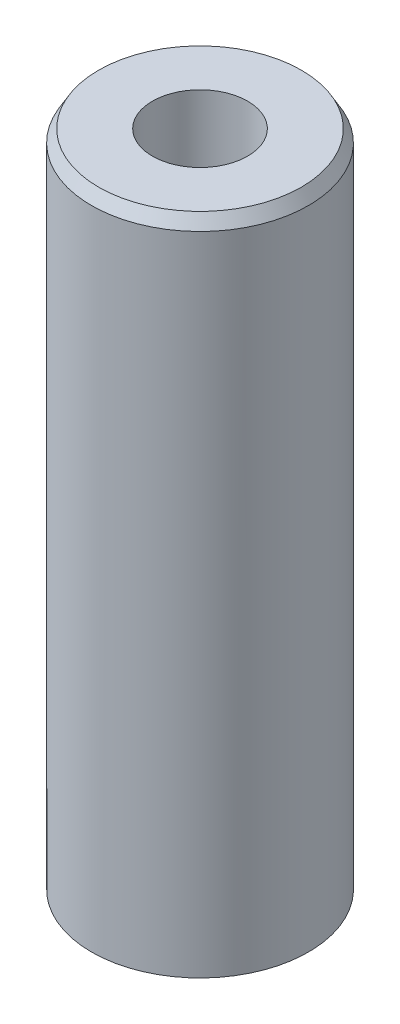
ISO-10303-21;
HEADER;
FILE_DESCRIPTION(('STEP AP214'),'2;1');
FILE_NAME('part.step','',(''),(''),'','','');
FILE_SCHEMA(('AUTOMOTIVE_DESIGN { 1 0 10303 214 1 1 1 1 }'));
ENDSEC;
DATA;
#1=APPLICATION_CONTEXT('core data for automotive mechanical design processes');
#2=APPLICATION_PROTOCOL_DEFINITION('international standard','automotive_design',2000,#1);
#3=PRODUCT_CONTEXT('',#1,'mechanical');
#4=PRODUCT('Part','Part','',(#3));
#5=PRODUCT_RELATED_PRODUCT_CATEGORY('part','',(#4));
#6=PRODUCT_DEFINITION_FORMATION('','',#4);
#7=PRODUCT_DEFINITION_CONTEXT('part definition',#1,'design');
#8=PRODUCT_DEFINITION('design','',#6,#7);
#9=PRODUCT_DEFINITION_SHAPE('','',#8);
#10=(LENGTH_UNIT() NAMED_UNIT(*) SI_UNIT(.MILLI.,.METRE.));
#11=(NAMED_UNIT(*) PLANE_ANGLE_UNIT() SI_UNIT($,.RADIAN.));
#12=(NAMED_UNIT(*) SI_UNIT($,.STERADIAN.) SOLID_ANGLE_UNIT());
#13=UNCERTAINTY_MEASURE_WITH_UNIT(LENGTH_MEASURE(1.E-05),#10,'distance_accuracy_value','');
#14=(GEOMETRIC_REPRESENTATION_CONTEXT(3) GLOBAL_UNCERTAINTY_ASSIGNED_CONTEXT((#13)) GLOBAL_UNIT_ASSIGNED_CONTEXT((#10,
#11,#12)) REPRESENTATION_CONTEXT('',''));
#15=CARTESIAN_POINT('',(0.,0.,0.));
#16=DIRECTION('',(0.,0.,1.));
#17=DIRECTION('',(1.,0.,0.));
#18=AXIS2_PLACEMENT_3D('',#15,#16,#17);
#19=CARTESIAN_POINT('',(0.,291.544816123996,0.));
#20=DIRECTION('',(0.,-1.,0.));
#21=DIRECTION('',(0.,0.,-1.));
#22=AXIS2_PLACEMENT_3D('',#19,#20,#21);
#23=CYLINDRICAL_SURFACE('',#22,47.5);
#24=CARTESIAN_POINT('',(0.,286.134468719318,0.));
#25=DIRECTION('',(0.,1.,0.));
#26=DIRECTION('',(0.,0.,1.));
#27=AXIS2_PLACEMENT_3D('',#24,#25,#26);
#28=CIRCLE('',#27,47.5);
#29=CARTESIAN_POINT('',(0.,286.134468719318,-47.5));
#30=VERTEX_POINT('',#29);
#31=EDGE_CURVE('E50',#30,#30,#28,.F.);
#32=CARTESIAN_POINT('',(0.,3.12366553050036,0.));
#33=DIRECTION('',(0.,1.,0.));
#34=DIRECTION('',(0.,0.,1.));
#35=AXIS2_PLACEMENT_3D('',#32,#33,#34);
#36=CIRCLE('',#35,47.5);
#37=CARTESIAN_POINT('',(0.,3.12366553050031,-47.5));
#38=VERTEX_POINT('',#37);
#39=EDGE_CURVE('E51',#38,#38,#36,.T.);
#40=CARTESIAN_POINT('',(0.,286.134468719318,-47.5));
#41=CARTESIAN_POINT('',(0.,283.186439519435,-47.5));
#42=CARTESIAN_POINT('',(0.,280.238410319551,-47.5));
#43=CARTESIAN_POINT('',(0.,274.342351919784,-47.5));
#44=CARTESIAN_POINT('',(0.,271.394322719901,-47.5));
#45=CARTESIAN_POINT('',(0.,265.498264320134,-47.5));
#46=CARTESIAN_POINT('',(0.,262.55023512025,-47.5));
#47=CARTESIAN_POINT('',(0.,256.654176720483,-47.5));
#48=CARTESIAN_POINT('',(0.,253.7061475206,-47.5));
#49=CARTESIAN_POINT('',(0.,247.810089120833,-47.5));
#50=CARTESIAN_POINT('',(0.,244.862059920949,-47.5));
#51=CARTESIAN_POINT('',(0.,238.966001521182,-47.5));
#52=CARTESIAN_POINT('',(0.,236.017972321299,-47.5));
#53=CARTESIAN_POINT('',(0.,230.121913921532,-47.5));
#54=CARTESIAN_POINT('',(0.,227.173884721648,-47.5));
#55=CARTESIAN_POINT('',(0.,221.277826321881,-47.5));
#56=CARTESIAN_POINT('',(0.,218.329797121997,-47.5));
#57=CARTESIAN_POINT('',(0.,212.43373872223,-47.5));
#58=CARTESIAN_POINT('',(0.,209.485709522347,-47.5));
#59=CARTESIAN_POINT('',(0.,203.58965112258,-47.5));
#60=CARTESIAN_POINT('',(0.,200.641621922696,-47.5));
#61=CARTESIAN_POINT('',(0.,194.745563522929,-47.5));
#62=CARTESIAN_POINT('',(0.,191.797534323046,-47.5));
#63=CARTESIAN_POINT('',(0.,185.901475923279,-47.5));
#64=CARTESIAN_POINT('',(0.,182.953446723395,-47.5));
#65=CARTESIAN_POINT('',(0.,177.057388323628,-47.5));
#66=CARTESIAN_POINT('',(0.,174.109359123745,-47.5));
#67=CARTESIAN_POINT('',(0.,168.213300723978,-47.5));
#68=CARTESIAN_POINT('',(0.,165.265271524094,-47.5));
#69=CARTESIAN_POINT('',(0.,159.369213124327,-47.5));
#70=CARTESIAN_POINT('',(0.,156.421183924443,-47.5));
#71=CARTESIAN_POINT('',(0.,150.525125524676,-47.5));
#72=CARTESIAN_POINT('',(0.,147.577096324793,-47.5));
#73=CARTESIAN_POINT('',(0.,141.681037925026,-47.5));
#74=CARTESIAN_POINT('',(0.,138.733008725142,-47.5));
#75=CARTESIAN_POINT('',(0.,132.836950325375,-47.5));
#76=CARTESIAN_POINT('',(0.,129.888921125492,-47.5));
#77=CARTESIAN_POINT('',(0.,123.992862725725,-47.5));
#78=CARTESIAN_POINT('',(0.,121.044833525841,-47.5));
#79=CARTESIAN_POINT('',(0.,115.148775126074,-47.5));
#80=CARTESIAN_POINT('',(0.,112.200745926191,-47.5));
#81=CARTESIAN_POINT('',(0.,106.304687526424,-47.5));
#82=CARTESIAN_POINT('',(0.,103.35665832654,-47.5));
#83=CARTESIAN_POINT('',(0.,97.460599926773,-47.5));
#84=CARTESIAN_POINT('',(0.,94.5125707268895,-47.5));
#85=CARTESIAN_POINT('',(0.,88.6165123271225,-47.5));
#86=CARTESIAN_POINT('',(0.,85.6684831272389,-47.5));
#87=CARTESIAN_POINT('',(0.,79.7724247274719,-47.5));
#88=CARTESIAN_POINT('',(0.,76.8243955275884,-47.5));
#89=CARTESIAN_POINT('',(0.,70.9283371278213,-47.5));
#90=CARTESIAN_POINT('',(0.,67.9803079279378,-47.5));
#91=CARTESIAN_POINT('',(0.,62.0842495281708,-47.5));
#92=CARTESIAN_POINT('',(0.,59.1362203282872,-47.5));
#93=CARTESIAN_POINT('',(0.,53.2401619285202,-47.5));
#94=CARTESIAN_POINT('',(0.,50.2921327286367,-47.5));
#95=CARTESIAN_POINT('',(0.,44.3960743288696,-47.5));
#96=CARTESIAN_POINT('',(0.,41.4480451289861,-47.5));
#97=CARTESIAN_POINT('',(0.,35.5519867292191,-47.5));
#98=CARTESIAN_POINT('',(0.,32.6039575293355,-47.5));
#99=CARTESIAN_POINT('',(0.,26.7078991295685,-47.5));
#100=CARTESIAN_POINT('',(0.,23.759869929685,-47.5));
#101=CARTESIAN_POINT('',(0.,17.8638115299179,-47.5));
#102=CARTESIAN_POINT('',(0.,14.9157823300344,-47.5));
#103=CARTESIAN_POINT('',(0.,9.01972393026734,-47.5));
#104=CARTESIAN_POINT('',(0.,6.07169473038382,-47.5));
#105=CARTESIAN_POINT('',(0.,3.12366553050031,-47.5));
#106=B_SPLINE_CURVE_WITH_KNOTS('',3,(#40,#41,#42,#43,#44,#45,#46,#47,#48,#49,#50,#51,#52,#53,
#54,#55,#56,#57,#58,#59,#60,#61,#62,#63,#64,#65,#66,#67,#68,#69,#70,#71,#72,#73,#74,#75,#76,#77,
#78,#79,#80,#81,#82,#83,#84,#85,#86,#87,#88,#89,#90,#91,#92,#93,#94,#95,#96,#97,#98,#99,#100,
#101,#102,#103,#104,#105),.UNSPECIFIED.,.F.,.F.,(4,2,2,2,2,2,2,2,2,2,2,2,2,2,2,2,2,2,2,2,2,2,2,
2,2,2,2,2,2,2,2,2,4),(0.,8.84408759965055,17.6881751993011,26.5322627989517,35.3763503986023,
44.2204379982528,53.0645255979034,61.9086131975539,70.7527007972045,79.5967883968551,
88.4408759965056,97.2849635961562,106.129051195807,114.973138795457,123.817226395108,
132.661313994758,141.505401594409,150.34948919406,159.19357679371,168.037664393361,
176.881751993011,185.725839592662,194.569927192312,203.414014791963,212.258102391614,
221.102189991264,229.946277590915,238.790365190565,247.634452790216,256.478540389866,
265.322627989517,274.166715589168,283.010803188818),.UNSPECIFIED.);
#107=EDGE_CURVE('BSEAM39',#30,#38,#106,.T.);
#108=ORIENTED_EDGE('',*,*,#31,.T.);
#109=ORIENTED_EDGE('',*,*,#39,.T.);
#110=ORIENTED_EDGE('',*,*,#107,.T.);
#111=ORIENTED_EDGE('',*,*,#107,.F.);
#112=EDGE_LOOP('',(#108,#110,#109,#111));
#113=FACE_BOUND('',#112,.T.);
#114=ADVANCED_FACE('F39',(#113),#23,.T.);
#115=CARTESIAN_POINT('',(0.,291.544816123996,0.));
#116=DIRECTION('',(0.,1.,0.));
#117=DIRECTION('',(0.,0.,1.));
#118=AXIS2_PLACEMENT_3D('',#115,#116,#117);
#119=PLANE('',#118);
#120=CARTESIAN_POINT('',(0.,291.544816123996,0.));
#121=DIRECTION('',(0.,1.,0.));
#122=DIRECTION('',(0.,0.,1.));
#123=AXIS2_PLACEMENT_3D('',#120,#121,#122);
#124=CIRCLE('',#123,44.3763344694998);
#125=CARTESIAN_POINT('',(0.,291.544816123996,44.3763344694998));
#126=VERTEX_POINT('',#125);
#127=EDGE_CURVE('E54',#126,#126,#124,.T.);
#128=ORIENTED_EDGE('',*,*,#127,.T.);
#129=EDGE_LOOP('',(#128));
#130=FACE_BOUND('',#129,.T.);
#131=CARTESIAN_POINT('',(0.,291.544816123996,0.));
#132=DIRECTION('',(0.,1.,0.));
#133=DIRECTION('',(0.,0.,1.));
#134=AXIS2_PLACEMENT_3D('',#131,#132,#133);
#135=CIRCLE('',#134,20.8582423337756);
#136=CARTESIAN_POINT('',(0.,291.544816123996,-20.8582423337756));
#137=VERTEX_POINT('',#136);
#138=EDGE_CURVE('E58',#137,#137,#135,.T.);
#139=ORIENTED_EDGE('',*,*,#138,.F.);
#140=EDGE_LOOP('',(#139));
#141=FACE_BOUND('',#140,.T.);
#142=ADVANCED_FACE('F69',(#130,#141),#119,.T.);
#143=CARTESIAN_POINT('',(0.,0.,0.));
#144=DIRECTION('',(0.,1.,0.));
#145=DIRECTION('',(0.,0.,1.));
#146=AXIS2_PLACEMENT_3D('',#143,#144,#145);
#147=PLANE('',#146);
#148=CARTESIAN_POINT('',(0.,0.,0.));
#149=DIRECTION('',(0.,1.,0.));
#150=DIRECTION('',(0.,0.,1.));
#151=AXIS2_PLACEMENT_3D('',#148,#149,#150);
#152=CIRCLE('',#151,42.0896525953218);
#153=CARTESIAN_POINT('',(0.,0.,42.0896525953218));
#154=VERTEX_POINT('',#153);
#155=EDGE_CURVE('E10',#154,#154,#152,.F.);
#156=ORIENTED_EDGE('',*,*,#155,.T.);
#157=EDGE_LOOP('',(#156));
#158=FACE_BOUND('',#157,.T.);
#159=CARTESIAN_POINT('',(0.,0.,0.));
#160=DIRECTION('',(0.,1.,0.));
#161=DIRECTION('',(0.,0.,1.));
#162=AXIS2_PLACEMENT_3D('',#159,#160,#161);
#163=CIRCLE('',#162,20.8582423337756);
#164=CARTESIAN_POINT('',(0.,0.,-20.8582423337756));
#165=VERTEX_POINT('',#164);
#166=EDGE_CURVE('E63',#165,#165,#163,.T.);
#167=ORIENTED_EDGE('',*,*,#166,.T.);
#168=EDGE_LOOP('',(#167));
#169=FACE_BOUND('',#168,.T.);
#170=ADVANCED_FACE('F75',(#158,#169),#147,.F.);
#171=CARTESIAN_POINT('',(0.,291.544816123996,0.));
#172=DIRECTION('',(0.,-1.,0.));
#173=DIRECTION('',(0.,0.,-1.));
#174=AXIS2_PLACEMENT_3D('',#171,#172,#173);
#175=CYLINDRICAL_SURFACE('',#174,20.8582423337756);
#176=CARTESIAN_POINT('',(0.,291.544816123996,-20.8582423337756));
#177=CARTESIAN_POINT('',(0.,288.507890956038,-20.8582423337756));
#178=CARTESIAN_POINT('',(0.,285.47096578808,-20.8582423337756));
#179=CARTESIAN_POINT('',(0.,279.397115452163,-20.8582423337756));
#180=CARTESIAN_POINT('',(0.,276.360190284205,-20.8582423337756));
#181=CARTESIAN_POINT('',(0.,270.286339948288,-20.8582423337756));
#182=CARTESIAN_POINT('',(0.,267.24941478033,-20.8582423337756));
#183=CARTESIAN_POINT('',(0.,261.175564444414,-20.8582423337756));
#184=CARTESIAN_POINT('',(0.,258.138639276455,-20.8582423337756));
#185=CARTESIAN_POINT('',(0.,252.064788940539,-20.8582423337756));
#186=CARTESIAN_POINT('',(0.,249.02786377258,-20.8582423337756));
#187=CARTESIAN_POINT('',(0.,242.954013436664,-20.8582423337756));
#188=CARTESIAN_POINT('',(0.,239.917088268705,-20.8582423337756));
#189=CARTESIAN_POINT('',(0.,233.843237932789,-20.8582423337756));
#190=CARTESIAN_POINT('',(0.,230.806312764831,-20.8582423337756));
#191=CARTESIAN_POINT('',(0.,224.732462428914,-20.8582423337756));
#192=CARTESIAN_POINT('',(0.,221.695537260956,-20.8582423337756));
#193=CARTESIAN_POINT('',(0.,215.621686925039,-20.8582423337756));
#194=CARTESIAN_POINT('',(0.,212.584761757081,-20.8582423337756));
#195=CARTESIAN_POINT('',(0.,206.510911421164,-20.8582423337756));
#196=CARTESIAN_POINT('',(0.,203.473986253206,-20.8582423337756));
#197=CARTESIAN_POINT('',(0.,197.400135917289,-20.8582423337756));
#198=CARTESIAN_POINT('',(0.,194.363210749331,-20.8582423337756));
#199=CARTESIAN_POINT('',(0.,188.289360413414,-20.8582423337756));
#200=CARTESIAN_POINT('',(0.,185.252435245456,-20.8582423337756));
#201=CARTESIAN_POINT('',(0.,179.178584909539,-20.8582423337756));
#202=CARTESIAN_POINT('',(0.,176.141659741581,-20.8582423337756));
#203=CARTESIAN_POINT('',(0.,170.067809405665,-20.8582423337756));
#204=CARTESIAN_POINT('',(0.,167.030884237706,-20.8582423337756));
#205=CARTESIAN_POINT('',(0.,160.95703390179,-20.8582423337756));
#206=CARTESIAN_POINT('',(0.,157.920108733831,-20.8582423337756));
#207=CARTESIAN_POINT('',(0.,151.846258397915,-20.8582423337756));
#208=CARTESIAN_POINT('',(0.,148.809333229957,-20.8582423337756));
#209=CARTESIAN_POINT('',(0.,142.73548289404,-20.8582423337756));
#210=CARTESIAN_POINT('',(0.,139.698557726082,-20.8582423337756));
#211=CARTESIAN_POINT('',(0.,133.624707390165,-20.8582423337756));
#212=CARTESIAN_POINT('',(0.,130.587782222207,-20.8582423337756));
#213=CARTESIAN_POINT('',(0.,124.51393188629,-20.8582423337756));
#214=CARTESIAN_POINT('',(0.,121.477006718332,-20.8582423337756));
#215=CARTESIAN_POINT('',(0.,115.403156382415,-20.8582423337756));
#216=CARTESIAN_POINT('',(0.,112.366231214457,-20.8582423337756));
#217=CARTESIAN_POINT('',(0.,106.29238087854,-20.8582423337756));
#218=CARTESIAN_POINT('',(0.,103.255455710582,-20.8582423337756));
#219=CARTESIAN_POINT('',(0.,97.1816053746655,-20.8582423337756));
#220=CARTESIAN_POINT('',(0.,94.1446802067072,-20.8582423337756));
#221=CARTESIAN_POINT('',(0.,88.0708298707906,-20.8582423337756));
#222=CARTESIAN_POINT('',(0.,85.0339047028323,-20.8582423337756));
#223=CARTESIAN_POINT('',(0.,78.9600543669157,-20.8582423337756));
#224=CARTESIAN_POINT('',(0.,75.9231291989574,-20.8582423337756));
#225=CARTESIAN_POINT('',(0.,69.8492788630408,-20.8582423337756));
#226=CARTESIAN_POINT('',(0.,66.8123536950825,-20.8582423337756));
#227=CARTESIAN_POINT('',(0.,60.7385033591659,-20.8582423337756));
#228=CARTESIAN_POINT('',(0.,57.7015781912076,-20.8582423337756));
#229=CARTESIAN_POINT('',(0.,51.627727855291,-20.8582423337756));
#230=CARTESIAN_POINT('',(0.,48.5908026873327,-20.8582423337756));
#231=CARTESIAN_POINT('',(0.,42.5169523514161,-20.8582423337756));
#232=CARTESIAN_POINT('',(0.,39.4800271834578,-20.8582423337756));
#233=CARTESIAN_POINT('',(0.,33.4061768475412,-20.8582423337756));
#234=CARTESIAN_POINT('',(0.,30.3692516795829,-20.8582423337756));
#235=CARTESIAN_POINT('',(0.,24.2954013436663,-20.8582423337756));
#236=CARTESIAN_POINT('',(0.,21.258476175708,-20.8582423337756));
#237=CARTESIAN_POINT('',(0.,15.1846258397914,-20.8582423337756));
#238=CARTESIAN_POINT('',(0.,12.1477006718331,-20.8582423337756));
#239=CARTESIAN_POINT('',(0.,6.07385033591655,-20.8582423337756));
#240=CARTESIAN_POINT('',(0.,3.03692516795824,-20.8582423337756));
#241=CARTESIAN_POINT('',(0.,0.,-20.8582423337756));
#242=B_SPLINE_CURVE_WITH_KNOTS('',3,(#176,#177,#178,#179,#180,#181,#182,#183,#184,#185,#186,
#187,#188,#189,#190,#191,#192,#193,#194,#195,#196,#197,#198,#199,#200,#201,#202,#203,#204,#205,
#206,#207,#208,#209,#210,#211,#212,#213,#214,#215,#216,#217,#218,#219,#220,#221,#222,#223,#224,
#225,#226,#227,#228,#229,#230,#231,#232,#233,#234,#235,#236,#237,#238,#239,#240,#241),
.UNSPECIFIED.,.F.,.F.,(4,2,2,2,2,2,2,2,2,2,2,2,2,2,2,2,2,2,2,2,2,2,2,2,2,2,2,2,2,2,2,2,4),(0.,
9.11077550387485,18.2215510077497,27.3323265116247,36.4431020154995,45.5538775193744,
54.6646530232493,63.7754285271242,72.8862040309991,81.996979534874,91.1077550387489,
100.218530542624,109.329306046499,118.440081550374,127.550857054248,136.661632558123,
145.772408061998,154.883183565873,163.993959069748,173.104734573623,182.215510077498,
191.326285581373,200.437061085248,209.547836589122,218.658612092997,227.769387596872,
236.880163100747,245.990938604622,255.101714108497,264.212489612372,273.323265116247,
282.434040620122,291.544816123996),.UNSPECIFIED.);
#243=EDGE_CURVE('BSEAM70',#137,#165,#242,.T.);
#244=ORIENTED_EDGE('',*,*,#138,.T.);
#245=ORIENTED_EDGE('',*,*,#166,.F.);
#246=ORIENTED_EDGE('',*,*,#243,.T.);
#247=ORIENTED_EDGE('',*,*,#243,.F.);
#248=EDGE_LOOP('',(#244,#246,#245,#247));
#249=FACE_BOUND('',#248,.T.);
#250=ADVANCED_FACE('F70',(#249),#175,.F.);
#251=CARTESIAN_POINT('',(0.,291.544816123996,0.));
#252=DIRECTION('',(0.,-1.,0.));
#253=DIRECTION('',(0.,0.,-1.));
#254=AXIS2_PLACEMENT_3D('',#251,#252,#253);
#255=CONICAL_SURFACE('',#254,44.3763344694998,0.523598775598296);
#256=ORIENTED_EDGE('',*,*,#31,.F.);
#257=EDGE_LOOP('',(#256));
#258=FACE_BOUND('',#257,.T.);
#259=ORIENTED_EDGE('',*,*,#127,.F.);
#260=EDGE_LOOP('',(#259));
#261=FACE_BOUND('',#260,.T.);
#262=ADVANCED_FACE('F81',(#258,#261),#255,.T.);
#263=CARTESIAN_POINT('',(0.,3.12366553050036,0.));
#264=DIRECTION('',(0.,1.,0.));
#265=DIRECTION('',(0.,0.,1.));
#266=AXIS2_PLACEMENT_3D('',#263,#264,#265);
#267=CONICAL_SURFACE('',#266,47.5,1.0471975511966);
#268=ORIENTED_EDGE('',*,*,#155,.F.);
#269=EDGE_LOOP('',(#268));
#270=FACE_BOUND('',#269,.T.);
#271=ORIENTED_EDGE('',*,*,#39,.F.);
#272=EDGE_LOOP('',(#271));
#273=FACE_BOUND('',#272,.T.);
#274=ADVANCED_FACE('F45',(#270,#273),#267,.T.);
#275=CLOSED_SHELL('',(#114,#142,#170,#250,#262,#274));
#276=MANIFOLD_SOLID_BREP('B2',#275);
#277=ADVANCED_BREP_SHAPE_REPRESENTATION('',(#18,#276),#14);
#278=SHAPE_DEFINITION_REPRESENTATION(#9,#277);
ENDSEC;
END-ISO-10303-21;
